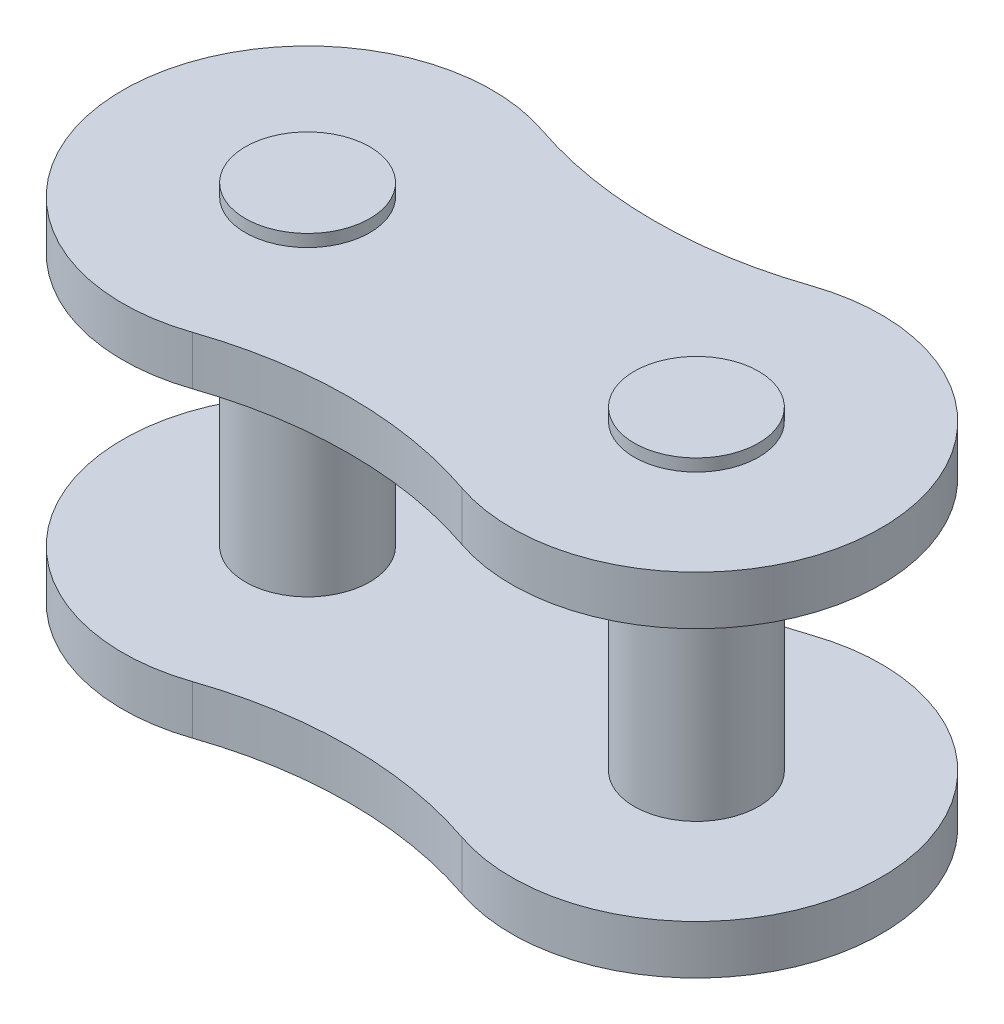
ISO-10303-21;
HEADER;
FILE_DESCRIPTION(('STEP AP214'),'2;1');
FILE_NAME('part.step','',(''),(''),'','','');
FILE_SCHEMA(('AUTOMOTIVE_DESIGN { 1 0 10303 214 1 1 1 1 }'));
ENDSEC;
DATA;
#1=APPLICATION_CONTEXT('core data for automotive mechanical design processes');
#2=APPLICATION_PROTOCOL_DEFINITION('international standard','automotive_design',2000,#1);
#3=PRODUCT_CONTEXT('',#1,'mechanical');
#4=PRODUCT('Part','Part','',(#3));
#5=PRODUCT_RELATED_PRODUCT_CATEGORY('part','',(#4));
#6=PRODUCT_DEFINITION_FORMATION('','',#4);
#7=PRODUCT_DEFINITION_CONTEXT('part definition',#1,'design');
#8=PRODUCT_DEFINITION('design','',#6,#7);
#9=PRODUCT_DEFINITION_SHAPE('','',#8);
#10=(LENGTH_UNIT() NAMED_UNIT(*) SI_UNIT(.MILLI.,.METRE.));
#11=(NAMED_UNIT(*) PLANE_ANGLE_UNIT() SI_UNIT($,.RADIAN.));
#12=(NAMED_UNIT(*) SI_UNIT($,.STERADIAN.) SOLID_ANGLE_UNIT());
#13=UNCERTAINTY_MEASURE_WITH_UNIT(LENGTH_MEASURE(1.E-05),#10,'distance_accuracy_value','');
#14=(GEOMETRIC_REPRESENTATION_CONTEXT(3) GLOBAL_UNCERTAINTY_ASSIGNED_CONTEXT((#13)) GLOBAL_UNIT_ASSIGNED_CONTEXT((#10,
#11,#12)) REPRESENTATION_CONTEXT('',''));
#15=CARTESIAN_POINT('',(0.,0.,0.));
#16=DIRECTION('',(0.,0.,1.));
#17=DIRECTION('',(1.,0.,0.));
#18=AXIS2_PLACEMENT_3D('',#15,#16,#17);
#19=CARTESIAN_POINT('',(15.875,-0.5,0.));
#20=DIRECTION('',(0.,1.,0.));
#21=DIRECTION('',(0.,0.,1.));
#22=AXIS2_PLACEMENT_3D('',#19,#20,#21);
#23=PLANE('',#22);
#24=CARTESIAN_POINT('',(15.875,-0.5,0.));
#25=DIRECTION('',(0.,1.,0.));
#26=DIRECTION('',(0.,0.,1.));
#27=AXIS2_PLACEMENT_3D('',#24,#25,#26);
#28=CIRCLE('',#27,2.54);
#29=CARTESIAN_POINT('',(15.875,-0.5,2.54));
#30=VERTEX_POINT('',#29);
#31=EDGE_CURVE('E19',#30,#30,#28,.T.);
#32=ORIENTED_EDGE('',*,*,#31,.F.);
#33=EDGE_LOOP('',(#32));
#34=FACE_BOUND('',#33,.T.);
#35=ADVANCED_FACE('F16',(#34),#23,.F.);
#36=CARTESIAN_POINT('',(0.,-0.5,0.));
#37=DIRECTION('',(0.,1.,0.));
#38=DIRECTION('',(0.,0.,1.));
#39=AXIS2_PLACEMENT_3D('',#36,#37,#38);
#40=PLANE('',#39);
#41=CARTESIAN_POINT('',(0.,-0.5,0.));
#42=DIRECTION('',(0.,1.,0.));
#43=DIRECTION('',(0.,0.,1.));
#44=AXIS2_PLACEMENT_3D('',#41,#42,#43);
#45=CIRCLE('',#44,2.54);
#46=CARTESIAN_POINT('',(0.,-0.5,2.54));
#47=VERTEX_POINT('',#46);
#48=EDGE_CURVE('E167',#47,#47,#45,.T.);
#49=ORIENTED_EDGE('',*,*,#48,.F.);
#50=EDGE_LOOP('',(#49));
#51=FACE_BOUND('',#50,.T.);
#52=ADVANCED_FACE('F177',(#51),#40,.F.);
#53=CARTESIAN_POINT('',(15.875,-0.5,0.));
#54=DIRECTION('',(0.,1.,0.));
#55=DIRECTION('',(0.,0.,1.));
#56=AXIS2_PLACEMENT_3D('',#53,#54,#55);
#57=CYLINDRICAL_SURFACE('',#56,2.54);
#58=CARTESIAN_POINT('',(15.875,0.,0.));
#59=DIRECTION('',(0.,1.,0.));
#60=DIRECTION('',(0.,0.,1.));
#61=AXIS2_PLACEMENT_3D('',#58,#59,#60);
#62=CIRCLE('',#61,2.54);
#63=CARTESIAN_POINT('',(15.875,0.,2.54));
#64=VERTEX_POINT('',#63);
#65=EDGE_CURVE('E165',#64,#64,#62,.F.);
#66=ORIENTED_EDGE('',*,*,#65,.T.);
#67=EDGE_LOOP('',(#66));
#68=FACE_BOUND('',#67,.T.);
#69=ORIENTED_EDGE('',*,*,#31,.T.);
#70=EDGE_LOOP('',(#69));
#71=FACE_BOUND('',#70,.T.);
#72=ADVANCED_FACE('F174',(#68,#71),#57,.T.);
#73=CARTESIAN_POINT('',(0.,-0.5,0.));
#74=DIRECTION('',(0.,1.,0.));
#75=DIRECTION('',(0.,0.,1.));
#76=AXIS2_PLACEMENT_3D('',#73,#74,#75);
#77=CYLINDRICAL_SURFACE('',#76,2.54);
#78=CARTESIAN_POINT('',(0.,0.,0.));
#79=DIRECTION('',(0.,1.,0.));
#80=DIRECTION('',(0.,0.,1.));
#81=AXIS2_PLACEMENT_3D('',#78,#79,#80);
#82=CIRCLE('',#81,2.54);
#83=CARTESIAN_POINT('',(0.,0.,2.54));
#84=VERTEX_POINT('',#83);
#85=EDGE_CURVE('E97',#84,#84,#82,.F.);
#86=ORIENTED_EDGE('',*,*,#85,.T.);
#87=EDGE_LOOP('',(#86));
#88=FACE_BOUND('',#87,.T.);
#89=ORIENTED_EDGE('',*,*,#48,.T.);
#90=EDGE_LOOP('',(#89));
#91=FACE_BOUND('',#90,.T.);
#92=ADVANCED_FACE('F252',(#88,#91),#77,.T.);
#93=CARTESIAN_POINT('',(11.90625,0.,-11.6130650427654));
#94=DIRECTION('',(0.,1.,0.));
#95=DIRECTION('',(0.,0.,1.));
#96=AXIS2_PLACEMENT_3D('',#93,#94,#95);
#97=PLANE('',#96);
#98=CARTESIAN_POINT('',(15.875,0.,0.));
#99=DIRECTION('',(0.,-1.,0.));
#100=DIRECTION('',(0.,0.,-1.));
#101=AXIS2_PLACEMENT_3D('',#98,#99,#100);
#102=CIRCLE('',#101,7.545);
#103=CARTESIAN_POINT('',(13.4350555102872,0.,7.13958653474557));
#104=VERTEX_POINT('',#103);
#105=CARTESIAN_POINT('',(13.4350555102872,0.,-7.13958653474557));
#106=VERTEX_POINT('',#105);
#107=EDGE_CURVE('E159',#104,#106,#102,.F.);
#108=ORIENTED_EDGE('',*,*,#107,.F.);
#109=CARTESIAN_POINT('',(7.9375,0.,23.2261300855308));
#110=DIRECTION('',(0.,-1.,0.));
#111=DIRECTION('',(0.,0.,-1.));
#112=AXIS2_PLACEMENT_3D('',#109,#110,#111);
#113=CIRCLE('',#112,17.);
#114=CARTESIAN_POINT('',(2.43994448971277,0.,7.13958653474557));
#115=VERTEX_POINT('',#114);
#116=EDGE_CURVE('E82',#104,#115,#113,.F.);
#117=ORIENTED_EDGE('',*,*,#116,.T.);
#118=CARTESIAN_POINT('',(0.,0.,0.));
#119=DIRECTION('',(0.,-1.,0.));
#120=DIRECTION('',(0.,0.,-1.));
#121=AXIS2_PLACEMENT_3D('',#118,#119,#120);
#122=CIRCLE('',#121,7.545);
#123=CARTESIAN_POINT('',(2.43994448971277,0.,-7.13958653474557));
#124=VERTEX_POINT('',#123);
#125=EDGE_CURVE('E75',#124,#115,#122,.F.);
#126=ORIENTED_EDGE('',*,*,#125,.F.);
#127=CARTESIAN_POINT('',(7.9375,0.,-23.2261300855308));
#128=DIRECTION('',(0.,-1.,0.));
#129=DIRECTION('',(0.,0.,-1.));
#130=AXIS2_PLACEMENT_3D('',#127,#128,#129);
#131=CIRCLE('',#130,17.);
#132=EDGE_CURVE('E79',#124,#106,#131,.F.);
#133=ORIENTED_EDGE('',*,*,#132,.T.);
#134=EDGE_LOOP('',(#108,#117,#126,#133));
#135=FACE_BOUND('',#134,.T.);
#136=ORIENTED_EDGE('',*,*,#85,.F.);
#137=EDGE_LOOP('',(#136));
#138=FACE_BOUND('',#137,.T.);
#139=ORIENTED_EDGE('',*,*,#65,.F.);
#140=EDGE_LOOP('',(#139));
#141=FACE_BOUND('',#140,.T.);
#142=ADVANCED_FACE('F77',(#135,#138,#141),#97,.F.);
#143=CARTESIAN_POINT('',(15.875,14.85,0.));
#144=DIRECTION('',(0.,-1.,0.));
#145=DIRECTION('',(0.,0.,-1.));
#146=AXIS2_PLACEMENT_3D('',#143,#144,#145);
#147=PLANE('',#146);
#148=CARTESIAN_POINT('',(15.875,14.85,0.));
#149=DIRECTION('',(0.,-1.,0.));
#150=DIRECTION('',(0.,0.,-1.));
#151=AXIS2_PLACEMENT_3D('',#148,#149,#150);
#152=CIRCLE('',#151,2.54);
#153=CARTESIAN_POINT('',(15.875,14.85,-2.54));
#154=VERTEX_POINT('',#153);
#155=EDGE_CURVE('E156',#154,#154,#152,.T.);
#156=ORIENTED_EDGE('',*,*,#155,.F.);
#157=EDGE_LOOP('',(#156));
#158=FACE_BOUND('',#157,.T.);
#159=ADVANCED_FACE('F245',(#158),#147,.F.);
#160=CARTESIAN_POINT('',(0.,14.85,0.));
#161=DIRECTION('',(0.,-1.,0.));
#162=DIRECTION('',(0.,0.,-1.));
#163=AXIS2_PLACEMENT_3D('',#160,#161,#162);
#164=PLANE('',#163);
#165=CARTESIAN_POINT('',(0.,14.85,0.));
#166=DIRECTION('',(0.,-1.,0.));
#167=DIRECTION('',(0.,0.,-1.));
#168=AXIS2_PLACEMENT_3D('',#165,#166,#167);
#169=CIRCLE('',#168,2.54);
#170=CARTESIAN_POINT('',(0.,14.85,-2.54));
#171=VERTEX_POINT('',#170);
#172=EDGE_CURVE('E153',#171,#171,#169,.T.);
#173=ORIENTED_EDGE('',*,*,#172,.F.);
#174=EDGE_LOOP('',(#173));
#175=FACE_BOUND('',#174,.T.);
#176=ADVANCED_FACE('F242',(#175),#164,.F.);
#177=CARTESIAN_POINT('',(7.9375,2.,-23.2261300855308));
#178=DIRECTION('',(0.,-1.,0.));
#179=DIRECTION('',(0.,0.,-1.));
#180=AXIS2_PLACEMENT_3D('',#177,#178,#179);
#181=CYLINDRICAL_SURFACE('',#180,17.);
#182=DIRECTION('',(0.,-1.,0.));
#183=VECTOR('',#182,1.);
#184=CARTESIAN_POINT('',(2.43994448971277,2.,-7.13958653474557));
#185=LINE('',#184,#183);
#186=CARTESIAN_POINT('',(2.43994448971277,2.,-7.13958653474557));
#187=VERTEX_POINT('',#186);
#188=EDGE_CURVE('E88',#187,#124,#185,.T.);
#189=ORIENTED_EDGE('',*,*,#188,.F.);
#190=CARTESIAN_POINT('',(7.9375,2.,-23.2261300855308));
#191=DIRECTION('',(0.,-1.,0.));
#192=DIRECTION('',(0.,0.,-1.));
#193=AXIS2_PLACEMENT_3D('',#190,#191,#192);
#194=CIRCLE('',#193,17.);
#195=CARTESIAN_POINT('',(13.4350555102872,2.,-7.13958653474557));
#196=VERTEX_POINT('',#195);
#197=EDGE_CURVE('E151',#196,#187,#194,.T.);
#198=ORIENTED_EDGE('',*,*,#197,.F.);
#199=DIRECTION('',(0.,-1.,0.));
#200=VECTOR('',#199,1.);
#201=CARTESIAN_POINT('',(13.4350555102872,2.,-7.13958653474557));
#202=LINE('',#201,#200);
#203=EDGE_CURVE('E95',#106,#196,#202,.F.);
#204=ORIENTED_EDGE('',*,*,#203,.F.);
#205=ORIENTED_EDGE('',*,*,#132,.F.);
#206=EDGE_LOOP('',(#189,#198,#204,#205));
#207=FACE_BOUND('',#206,.T.);
#208=ADVANCED_FACE('F92',(#207),#181,.F.);
#209=CARTESIAN_POINT('',(0.,2.,0.));
#210=DIRECTION('',(0.,-1.,0.));
#211=DIRECTION('',(0.,0.,-1.));
#212=AXIS2_PLACEMENT_3D('',#209,#210,#211);
#213=CYLINDRICAL_SURFACE('',#212,7.545);
#214=ORIENTED_EDGE('',*,*,#125,.T.);
#215=DIRECTION('',(0.,-1.,0.));
#216=VECTOR('',#215,1.);
#217=CARTESIAN_POINT('',(2.43994448971277,2.,7.13958653474557));
#218=LINE('',#217,#216);
#219=CARTESIAN_POINT('',(2.43994448971277,2.,7.13958653474557));
#220=VERTEX_POINT('',#219);
#221=EDGE_CURVE('E87',#115,#220,#218,.F.);
#222=ORIENTED_EDGE('',*,*,#221,.T.);
#223=CARTESIAN_POINT('',(0.,2.,0.));
#224=DIRECTION('',(0.,-1.,0.));
#225=DIRECTION('',(0.,0.,-1.));
#226=AXIS2_PLACEMENT_3D('',#223,#224,#225);
#227=CIRCLE('',#226,7.545);
#228=EDGE_CURVE('E101',#187,#220,#227,.F.);
#229=ORIENTED_EDGE('',*,*,#228,.F.);
#230=ORIENTED_EDGE('',*,*,#188,.T.);
#231=EDGE_LOOP('',(#214,#222,#229,#230));
#232=FACE_BOUND('',#231,.T.);
#233=ADVANCED_FACE('F99',(#232),#213,.T.);
#234=CARTESIAN_POINT('',(7.9375,2.,23.2261300855308));
#235=DIRECTION('',(0.,-1.,0.));
#236=DIRECTION('',(0.,0.,-1.));
#237=AXIS2_PLACEMENT_3D('',#234,#235,#236);
#238=CYLINDRICAL_SURFACE('',#237,17.);
#239=CARTESIAN_POINT('',(7.9375,2.,23.2261300855308));
#240=DIRECTION('',(0.,-1.,0.));
#241=DIRECTION('',(0.,0.,-1.));
#242=AXIS2_PLACEMENT_3D('',#239,#240,#241);
#243=CIRCLE('',#242,17.);
#244=CARTESIAN_POINT('',(13.4350555102872,2.,7.13958653474557));
#245=VERTEX_POINT('',#244);
#246=EDGE_CURVE('E147',#220,#245,#243,.T.);
#247=ORIENTED_EDGE('',*,*,#246,.F.);
#248=ORIENTED_EDGE('',*,*,#221,.F.);
#249=ORIENTED_EDGE('',*,*,#116,.F.);
#250=DIRECTION('',(0.,-1.,0.));
#251=VECTOR('',#250,1.);
#252=CARTESIAN_POINT('',(13.4350555102872,2.,7.13958653474557));
#253=LINE('',#252,#251);
#254=EDGE_CURVE('E161',#245,#104,#253,.T.);
#255=ORIENTED_EDGE('',*,*,#254,.F.);
#256=EDGE_LOOP('',(#247,#248,#249,#255));
#257=FACE_BOUND('',#256,.T.);
#258=ADVANCED_FACE('F233',(#257),#238,.F.);
#259=CARTESIAN_POINT('',(15.875,2.,0.));
#260=DIRECTION('',(0.,-1.,0.));
#261=DIRECTION('',(0.,0.,-1.));
#262=AXIS2_PLACEMENT_3D('',#259,#260,#261);
#263=CYLINDRICAL_SURFACE('',#262,7.545);
#264=ORIENTED_EDGE('',*,*,#107,.T.);
#265=ORIENTED_EDGE('',*,*,#203,.T.);
#266=CARTESIAN_POINT('',(15.875,2.,0.));
#267=DIRECTION('',(0.,-1.,0.));
#268=DIRECTION('',(0.,0.,-1.));
#269=AXIS2_PLACEMENT_3D('',#266,#267,#268);
#270=CIRCLE('',#269,7.545);
#271=EDGE_CURVE('E144',#245,#196,#270,.F.);
#272=ORIENTED_EDGE('',*,*,#271,.F.);
#273=ORIENTED_EDGE('',*,*,#254,.T.);
#274=EDGE_LOOP('',(#264,#265,#272,#273));
#275=FACE_BOUND('',#274,.T.);
#276=ADVANCED_FACE('F229',(#275),#263,.T.);
#277=CARTESIAN_POINT('',(15.875,14.85,0.));
#278=DIRECTION('',(0.,-1.,0.));
#279=DIRECTION('',(0.,0.,-1.));
#280=AXIS2_PLACEMENT_3D('',#277,#278,#279);
#281=CYLINDRICAL_SURFACE('',#280,2.54);
#282=ORIENTED_EDGE('',*,*,#155,.T.);
#283=EDGE_LOOP('',(#282));
#284=FACE_BOUND('',#283,.T.);
#285=CARTESIAN_POINT('',(15.875,14.35,0.));
#286=DIRECTION('',(0.,-1.,0.));
#287=DIRECTION('',(0.,0.,-1.));
#288=AXIS2_PLACEMENT_3D('',#285,#286,#287);
#289=CIRCLE('',#288,2.54);
#290=CARTESIAN_POINT('',(15.875,14.35,-2.54));
#291=VERTEX_POINT('',#290);
#292=EDGE_CURVE('E141',#291,#291,#289,.F.);
#293=ORIENTED_EDGE('',*,*,#292,.T.);
#294=EDGE_LOOP('',(#293));
#295=FACE_BOUND('',#294,.T.);
#296=ADVANCED_FACE('F225',(#284,#295),#281,.T.);
#297=CARTESIAN_POINT('',(0.,14.85,0.));
#298=DIRECTION('',(0.,-1.,0.));
#299=DIRECTION('',(0.,0.,-1.));
#300=AXIS2_PLACEMENT_3D('',#297,#298,#299);
#301=CYLINDRICAL_SURFACE('',#300,2.54);
#302=ORIENTED_EDGE('',*,*,#172,.T.);
#303=EDGE_LOOP('',(#302));
#304=FACE_BOUND('',#303,.T.);
#305=CARTESIAN_POINT('',(0.,14.35,0.));
#306=DIRECTION('',(0.,-1.,0.));
#307=DIRECTION('',(0.,0.,-1.));
#308=AXIS2_PLACEMENT_3D('',#305,#306,#307);
#309=CIRCLE('',#308,2.54);
#310=CARTESIAN_POINT('',(0.,14.35,-2.54));
#311=VERTEX_POINT('',#310);
#312=EDGE_CURVE('E138',#311,#311,#309,.F.);
#313=ORIENTED_EDGE('',*,*,#312,.T.);
#314=EDGE_LOOP('',(#313));
#315=FACE_BOUND('',#314,.T.);
#316=ADVANCED_FACE('F221',(#304,#315),#301,.T.);
#317=CARTESIAN_POINT('',(11.90625,2.,-11.6130650427654));
#318=DIRECTION('',(0.,1.,0.));
#319=DIRECTION('',(0.,0.,1.));
#320=AXIS2_PLACEMENT_3D('',#317,#318,#319);
#321=PLANE('',#320);
#322=ORIENTED_EDGE('',*,*,#246,.T.);
#323=ORIENTED_EDGE('',*,*,#271,.T.);
#324=ORIENTED_EDGE('',*,*,#197,.T.);
#325=ORIENTED_EDGE('',*,*,#228,.T.);
#326=EDGE_LOOP('',(#322,#323,#324,#325));
#327=FACE_BOUND('',#326,.T.);
#328=CARTESIAN_POINT('',(0.,2.,0.));
#329=DIRECTION('',(0.,1.,0.));
#330=DIRECTION('',(0.,0.,1.));
#331=AXIS2_PLACEMENT_3D('',#328,#329,#330);
#332=CIRCLE('',#331,2.54);
#333=CARTESIAN_POINT('',(0.,2.,2.54));
#334=VERTEX_POINT('',#333);
#335=EDGE_CURVE('E132',#334,#334,#332,.T.);
#336=ORIENTED_EDGE('',*,*,#335,.F.);
#337=EDGE_LOOP('',(#336));
#338=FACE_BOUND('',#337,.T.);
#339=CARTESIAN_POINT('',(15.875,2.,0.));
#340=DIRECTION('',(0.,1.,0.));
#341=DIRECTION('',(0.,0.,1.));
#342=AXIS2_PLACEMENT_3D('',#339,#340,#341);
#343=CIRCLE('',#342,2.54);
#344=CARTESIAN_POINT('',(15.875,2.,2.54));
#345=VERTEX_POINT('',#344);
#346=EDGE_CURVE('E135',#345,#345,#343,.T.);
#347=ORIENTED_EDGE('',*,*,#346,.F.);
#348=EDGE_LOOP('',(#347));
#349=FACE_BOUND('',#348,.T.);
#350=ADVANCED_FACE('F217',(#327,#338,#349),#321,.T.);
#351=CARTESIAN_POINT('',(11.90625,14.35,-11.6130650427654));
#352=DIRECTION('',(0.,-1.,0.));
#353=DIRECTION('',(0.,0.,-1.));
#354=AXIS2_PLACEMENT_3D('',#351,#352,#353);
#355=PLANE('',#354);
#356=CARTESIAN_POINT('',(0.,14.35,0.));
#357=DIRECTION('',(0.,1.,0.));
#358=DIRECTION('',(0.,0.,1.));
#359=AXIS2_PLACEMENT_3D('',#356,#357,#358);
#360=CIRCLE('',#359,7.545);
#361=CARTESIAN_POINT('',(2.43994448971277,14.35,7.13958653474557));
#362=VERTEX_POINT('',#361);
#363=CARTESIAN_POINT('',(2.43994448971277,14.35,-7.13958653474557));
#364=VERTEX_POINT('',#363);
#365=EDGE_CURVE('E119',#362,#364,#360,.F.);
#366=ORIENTED_EDGE('',*,*,#365,.F.);
#367=CARTESIAN_POINT('',(7.9375,14.35,23.2261300855308));
#368=DIRECTION('',(0.,1.,0.));
#369=DIRECTION('',(0.,0.,1.));
#370=AXIS2_PLACEMENT_3D('',#367,#368,#369);
#371=CIRCLE('',#370,17.);
#372=CARTESIAN_POINT('',(13.4350555102872,14.35,7.13958653474557));
#373=VERTEX_POINT('',#372);
#374=EDGE_CURVE('E123',#362,#373,#371,.F.);
#375=ORIENTED_EDGE('',*,*,#374,.T.);
#376=CARTESIAN_POINT('',(15.875,14.35,0.));
#377=DIRECTION('',(0.,1.,0.));
#378=DIRECTION('',(0.,0.,1.));
#379=AXIS2_PLACEMENT_3D('',#376,#377,#378);
#380=CIRCLE('',#379,7.545);
#381=CARTESIAN_POINT('',(13.4350555102872,14.35,-7.13958653474557));
#382=VERTEX_POINT('',#381);
#383=EDGE_CURVE('E126',#382,#373,#380,.F.);
#384=ORIENTED_EDGE('',*,*,#383,.F.);
#385=CARTESIAN_POINT('',(7.9375,14.35,-23.2261300855308));
#386=DIRECTION('',(0.,1.,0.));
#387=DIRECTION('',(0.,0.,1.));
#388=AXIS2_PLACEMENT_3D('',#385,#386,#387);
#389=CIRCLE('',#388,17.);
#390=EDGE_CURVE('E130',#382,#364,#389,.F.);
#391=ORIENTED_EDGE('',*,*,#390,.T.);
#392=EDGE_LOOP('',(#366,#375,#384,#391));
#393=FACE_BOUND('',#392,.T.);
#394=ORIENTED_EDGE('',*,*,#312,.F.);
#395=EDGE_LOOP('',(#394));
#396=FACE_BOUND('',#395,.T.);
#397=ORIENTED_EDGE('',*,*,#292,.F.);
#398=EDGE_LOOP('',(#397));
#399=FACE_BOUND('',#398,.T.);
#400=ADVANCED_FACE('F213',(#393,#396,#399),#355,.F.);
#401=CARTESIAN_POINT('',(15.875,-0.5,0.));
#402=DIRECTION('',(0.,1.,0.));
#403=DIRECTION('',(0.,0.,1.));
#404=AXIS2_PLACEMENT_3D('',#401,#402,#403);
#405=CYLINDRICAL_SURFACE('',#404,2.54);
#406=ORIENTED_EDGE('',*,*,#346,.T.);
#407=EDGE_LOOP('',(#406));
#408=FACE_BOUND('',#407,.T.);
#409=CARTESIAN_POINT('',(15.875,12.35,0.));
#410=DIRECTION('',(0.,1.,0.));
#411=DIRECTION('',(0.,0.,1.));
#412=AXIS2_PLACEMENT_3D('',#409,#410,#411);
#413=CIRCLE('',#412,2.54);
#414=CARTESIAN_POINT('',(15.875,12.35,2.54));
#415=VERTEX_POINT('',#414);
#416=EDGE_CURVE('E115',#415,#415,#413,.T.);
#417=ORIENTED_EDGE('',*,*,#416,.F.);
#418=EDGE_LOOP('',(#417));
#419=FACE_BOUND('',#418,.T.);
#420=ADVANCED_FACE('F209',(#408,#419),#405,.T.);
#421=CARTESIAN_POINT('',(0.,-0.5,0.));
#422=DIRECTION('',(0.,1.,0.));
#423=DIRECTION('',(0.,0.,1.));
#424=AXIS2_PLACEMENT_3D('',#421,#422,#423);
#425=CYLINDRICAL_SURFACE('',#424,2.54);
#426=ORIENTED_EDGE('',*,*,#335,.T.);
#427=EDGE_LOOP('',(#426));
#428=FACE_BOUND('',#427,.T.);
#429=CARTESIAN_POINT('',(0.,12.35,0.));
#430=DIRECTION('',(0.,1.,0.));
#431=DIRECTION('',(0.,0.,1.));
#432=AXIS2_PLACEMENT_3D('',#429,#430,#431);
#433=CIRCLE('',#432,2.54);
#434=CARTESIAN_POINT('',(0.,12.35,2.54));
#435=VERTEX_POINT('',#434);
#436=EDGE_CURVE('E112',#435,#435,#433,.T.);
#437=ORIENTED_EDGE('',*,*,#436,.F.);
#438=EDGE_LOOP('',(#437));
#439=FACE_BOUND('',#438,.T.);
#440=ADVANCED_FACE('F205',(#428,#439),#425,.T.);
#441=CARTESIAN_POINT('',(7.9375,12.35,-23.2261300855308));
#442=DIRECTION('',(0.,1.,0.));
#443=DIRECTION('',(0.,0.,1.));
#444=AXIS2_PLACEMENT_3D('',#441,#442,#443);
#445=CYLINDRICAL_SURFACE('',#444,17.);
#446=DIRECTION('',(0.,1.,0.));
#447=VECTOR('',#446,1.);
#448=CARTESIAN_POINT('',(13.4350555102872,12.35,-7.13958653474557));
#449=LINE('',#448,#447);
#450=CARTESIAN_POINT('',(13.4350555102872,12.35,-7.13958653474557));
#451=VERTEX_POINT('',#450);
#452=EDGE_CURVE('E129',#451,#382,#449,.T.);
#453=ORIENTED_EDGE('',*,*,#452,.F.);
#454=CARTESIAN_POINT('',(7.9375,12.35,-23.2261300855308));
#455=DIRECTION('',(0.,1.,0.));
#456=DIRECTION('',(0.,0.,1.));
#457=AXIS2_PLACEMENT_3D('',#454,#455,#456);
#458=CIRCLE('',#457,17.);
#459=CARTESIAN_POINT('',(2.43994448971277,12.35,-7.13958653474557));
#460=VERTEX_POINT('',#459);
#461=EDGE_CURVE('E109',#460,#451,#458,.T.);
#462=ORIENTED_EDGE('',*,*,#461,.F.);
#463=DIRECTION('',(0.,1.,0.));
#464=VECTOR('',#463,1.);
#465=CARTESIAN_POINT('',(2.43994448971277,12.35,-7.13958653474557));
#466=LINE('',#465,#464);
#467=EDGE_CURVE('E118',#364,#460,#466,.F.);
#468=ORIENTED_EDGE('',*,*,#467,.F.);
#469=ORIENTED_EDGE('',*,*,#390,.F.);
#470=EDGE_LOOP('',(#453,#462,#468,#469));
#471=FACE_BOUND('',#470,.T.);
#472=ADVANCED_FACE('F201',(#471),#445,.F.);
#473=CARTESIAN_POINT('',(15.875,12.35,0.));
#474=DIRECTION('',(0.,1.,0.));
#475=DIRECTION('',(0.,0.,1.));
#476=AXIS2_PLACEMENT_3D('',#473,#474,#475);
#477=CYLINDRICAL_SURFACE('',#476,7.545);
#478=ORIENTED_EDGE('',*,*,#383,.T.);
#479=DIRECTION('',(0.,1.,0.));
#480=VECTOR('',#479,1.);
#481=CARTESIAN_POINT('',(13.4350555102872,12.35,7.13958653474557));
#482=LINE('',#481,#480);
#483=CARTESIAN_POINT('',(13.4350555102872,12.35,7.13958653474557));
#484=VERTEX_POINT('',#483);
#485=EDGE_CURVE('E125',#373,#484,#482,.F.);
#486=ORIENTED_EDGE('',*,*,#485,.T.);
#487=CARTESIAN_POINT('',(15.875,12.35,0.));
#488=DIRECTION('',(0.,1.,0.));
#489=DIRECTION('',(0.,0.,1.));
#490=AXIS2_PLACEMENT_3D('',#487,#488,#489);
#491=CIRCLE('',#490,7.545);
#492=EDGE_CURVE('E107',#451,#484,#491,.F.);
#493=ORIENTED_EDGE('',*,*,#492,.F.);
#494=ORIENTED_EDGE('',*,*,#452,.T.);
#495=EDGE_LOOP('',(#478,#486,#493,#494));
#496=FACE_BOUND('',#495,.T.);
#497=ADVANCED_FACE('F197',(#496),#477,.T.);
#498=CARTESIAN_POINT('',(7.9375,12.35,23.2261300855308));
#499=DIRECTION('',(0.,1.,0.));
#500=DIRECTION('',(0.,0.,1.));
#501=AXIS2_PLACEMENT_3D('',#498,#499,#500);
#502=CYLINDRICAL_SURFACE('',#501,17.);
#503=DIRECTION('',(0.,1.,0.));
#504=VECTOR('',#503,1.);
#505=CARTESIAN_POINT('',(2.43994448971277,12.35,7.13958653474557));
#506=LINE('',#505,#504);
#507=CARTESIAN_POINT('',(2.43994448971277,12.35,7.13958653474557));
#508=VERTEX_POINT('',#507);
#509=EDGE_CURVE('E122',#508,#362,#506,.T.);
#510=ORIENTED_EDGE('',*,*,#509,.F.);
#511=CARTESIAN_POINT('',(7.9375,12.35,23.2261300855308));
#512=DIRECTION('',(0.,1.,0.));
#513=DIRECTION('',(0.,0.,1.));
#514=AXIS2_PLACEMENT_3D('',#511,#512,#513);
#515=CIRCLE('',#514,17.);
#516=EDGE_CURVE('E25',#484,#508,#515,.T.);
#517=ORIENTED_EDGE('',*,*,#516,.F.);
#518=ORIENTED_EDGE('',*,*,#485,.F.);
#519=ORIENTED_EDGE('',*,*,#374,.F.);
#520=EDGE_LOOP('',(#510,#517,#518,#519));
#521=FACE_BOUND('',#520,.T.);
#522=ADVANCED_FACE('F190',(#521),#502,.F.);
#523=CARTESIAN_POINT('',(0.,12.35,0.));
#524=DIRECTION('',(0.,1.,0.));
#525=DIRECTION('',(0.,0.,1.));
#526=AXIS2_PLACEMENT_3D('',#523,#524,#525);
#527=CYLINDRICAL_SURFACE('',#526,7.545);
#528=ORIENTED_EDGE('',*,*,#365,.T.);
#529=ORIENTED_EDGE('',*,*,#467,.T.);
#530=CARTESIAN_POINT('',(0.,12.35,0.));
#531=DIRECTION('',(0.,1.,0.));
#532=DIRECTION('',(0.,0.,1.));
#533=AXIS2_PLACEMENT_3D('',#530,#531,#532);
#534=CIRCLE('',#533,7.545);
#535=EDGE_CURVE('E11',#508,#460,#534,.F.);
#536=ORIENTED_EDGE('',*,*,#535,.F.);
#537=ORIENTED_EDGE('',*,*,#509,.T.);
#538=EDGE_LOOP('',(#528,#529,#536,#537));
#539=FACE_BOUND('',#538,.T.);
#540=ADVANCED_FACE('F185',(#539),#527,.T.);
#541=CARTESIAN_POINT('',(11.90625,12.35,-11.6130650427654));
#542=DIRECTION('',(0.,-1.,0.));
#543=DIRECTION('',(0.,0.,-1.));
#544=AXIS2_PLACEMENT_3D('',#541,#542,#543);
#545=PLANE('',#544);
#546=ORIENTED_EDGE('',*,*,#535,.T.);
#547=ORIENTED_EDGE('',*,*,#461,.T.);
#548=ORIENTED_EDGE('',*,*,#492,.T.);
#549=ORIENTED_EDGE('',*,*,#516,.T.);
#550=EDGE_LOOP('',(#546,#547,#548,#549));
#551=FACE_BOUND('',#550,.T.);
#552=ORIENTED_EDGE('',*,*,#436,.T.);
#553=EDGE_LOOP('',(#552));
#554=FACE_BOUND('',#553,.T.);
#555=ORIENTED_EDGE('',*,*,#416,.T.);
#556=EDGE_LOOP('',(#555));
#557=FACE_BOUND('',#556,.T.);
#558=ADVANCED_FACE('F183',(#551,#554,#557),#545,.T.);
#559=CLOSED_SHELL('',(#35,#52,#72,#92,#142,#159,#176,#208,#233,#258,#276,#296,#316,#350,#400,
#420,#440,#472,#497,#522,#540,#558));
#560=MANIFOLD_SOLID_BREP('B1',#559);
#561=ADVANCED_BREP_SHAPE_REPRESENTATION('',(#18,#560),#14);
#562=SHAPE_DEFINITION_REPRESENTATION(#9,#561);
ENDSEC;
END-ISO-10303-21;
